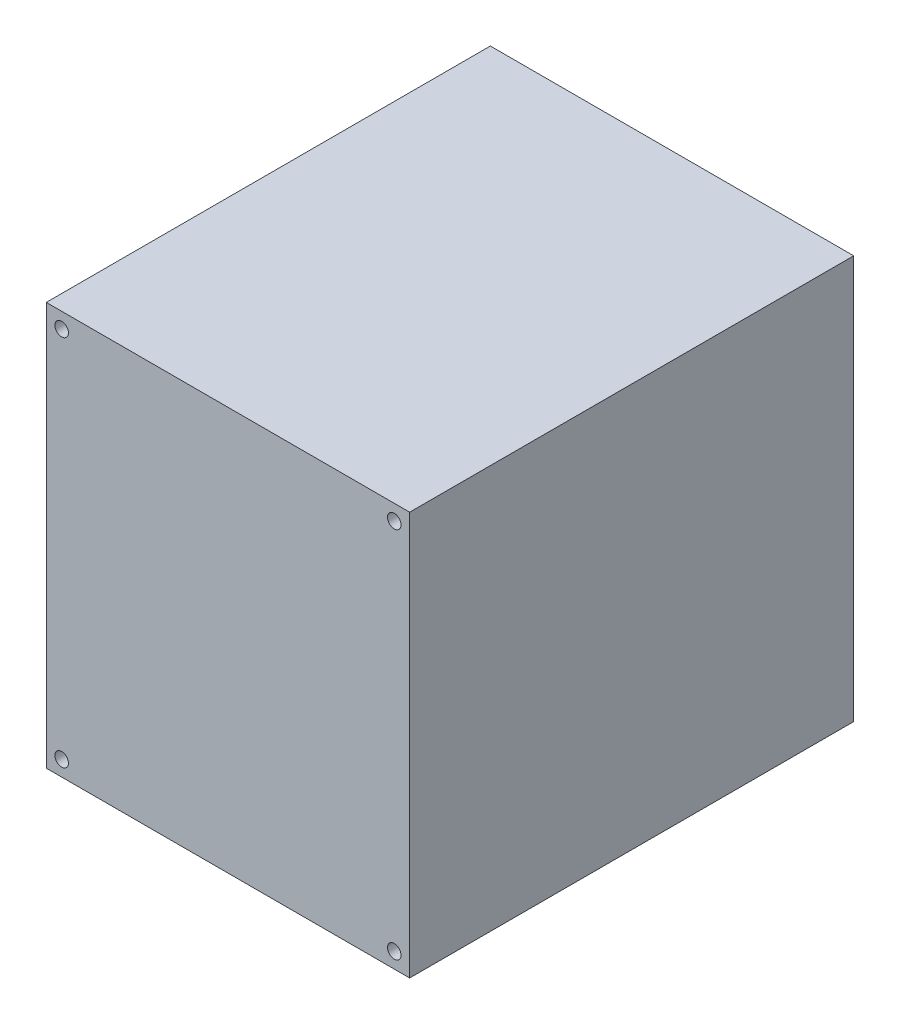
ISO-10303-21;
HEADER;
FILE_DESCRIPTION(('STEP AP214'),'2;1');
FILE_NAME('part.step','',(''),(''),'','','');
FILE_SCHEMA(('AUTOMOTIVE_DESIGN { 1 0 10303 214 1 1 1 1 }'));
ENDSEC;
DATA;
#1=APPLICATION_CONTEXT('core data for automotive mechanical design processes');
#2=APPLICATION_PROTOCOL_DEFINITION('international standard','automotive_design',2000,#1);
#3=PRODUCT_CONTEXT('',#1,'mechanical');
#4=PRODUCT('Part','Part','',(#3));
#5=PRODUCT_RELATED_PRODUCT_CATEGORY('part','',(#4));
#6=PRODUCT_DEFINITION_FORMATION('','',#4);
#7=PRODUCT_DEFINITION_CONTEXT('part definition',#1,'design');
#8=PRODUCT_DEFINITION('design','',#6,#7);
#9=PRODUCT_DEFINITION_SHAPE('','',#8);
#10=(LENGTH_UNIT() NAMED_UNIT(*) SI_UNIT(.MILLI.,.METRE.));
#11=(NAMED_UNIT(*) PLANE_ANGLE_UNIT() SI_UNIT($,.RADIAN.));
#12=(NAMED_UNIT(*) SI_UNIT($,.STERADIAN.) SOLID_ANGLE_UNIT());
#13=UNCERTAINTY_MEASURE_WITH_UNIT(LENGTH_MEASURE(1.E-05),#10,'distance_accuracy_value','');
#14=(GEOMETRIC_REPRESENTATION_CONTEXT(3) GLOBAL_UNCERTAINTY_ASSIGNED_CONTEXT((#13)) GLOBAL_UNIT_ASSIGNED_CONTEXT((#10,
#11,#12)) REPRESENTATION_CONTEXT('',''));
#15=CARTESIAN_POINT('',(0.,0.,0.));
#16=DIRECTION('',(0.,0.,1.));
#17=DIRECTION('',(1.,0.,0.));
#18=AXIS2_PLACEMENT_3D('',#15,#16,#17);
#19=CARTESIAN_POINT('',(59.,-65.5,144.2));
#20=DIRECTION('',(-1.,0.,0.));
#21=DIRECTION('',(0.,0.,1.));
#22=AXIS2_PLACEMENT_3D('',#19,#20,#21);
#23=PLANE('',#22);
#24=DIRECTION('',(0.,1.,0.));
#25=VECTOR('',#24,1.);
#26=CARTESIAN_POINT('',(59.,-65.5,0.));
#27=LINE('',#26,#25);
#28=CARTESIAN_POINT('',(59.,-65.5,0.));
#29=VERTEX_POINT('',#28);
#30=CARTESIAN_POINT('',(59.,65.5,0.));
#31=VERTEX_POINT('',#30);
#32=EDGE_CURVE('E98',#29,#31,#27,.T.);
#33=ORIENTED_EDGE('',*,*,#32,.T.);
#34=DIRECTION('',(0.,0.,-1.));
#35=VECTOR('',#34,1.);
#36=CARTESIAN_POINT('',(59.,65.5,144.2));
#37=LINE('',#36,#35);
#38=CARTESIAN_POINT('',(59.,65.5,144.2));
#39=VERTEX_POINT('',#38);
#40=EDGE_CURVE('E11',#39,#31,#37,.T.);
#41=ORIENTED_EDGE('',*,*,#40,.F.);
#42=DIRECTION('',(0.,1.,0.));
#43=VECTOR('',#42,1.);
#44=CARTESIAN_POINT('',(59.,-65.5,144.2));
#45=LINE('',#44,#43);
#46=CARTESIAN_POINT('',(59.,-65.5,144.2));
#47=VERTEX_POINT('',#46);
#48=EDGE_CURVE('E86',#47,#39,#45,.T.);
#49=ORIENTED_EDGE('',*,*,#48,.F.);
#50=DIRECTION('',(0.,0.,-1.));
#51=VECTOR('',#50,1.);
#52=CARTESIAN_POINT('',(59.,-65.5,144.2));
#53=LINE('',#52,#51);
#54=EDGE_CURVE('E94',#47,#29,#53,.T.);
#55=ORIENTED_EDGE('',*,*,#54,.T.);
#56=EDGE_LOOP('',(#33,#41,#49,#55));
#57=FACE_BOUND('',#56,.T.);
#58=ADVANCED_FACE('F35',(#57),#23,.F.);
#59=CARTESIAN_POINT('',(-59.,65.5,144.2));
#60=DIRECTION('',(0.,-1.,0.));
#61=DIRECTION('',(0.,0.,-1.));
#62=AXIS2_PLACEMENT_3D('',#59,#60,#61);
#63=PLANE('',#62);
#64=DIRECTION('',(-1.,0.,0.));
#65=VECTOR('',#64,1.);
#66=CARTESIAN_POINT('',(-59.,65.5,0.));
#67=LINE('',#66,#65);
#68=CARTESIAN_POINT('',(-59.,65.5,0.));
#69=VERTEX_POINT('',#68);
#70=EDGE_CURVE('E90',#31,#69,#67,.T.);
#71=ORIENTED_EDGE('',*,*,#70,.T.);
#72=DIRECTION('',(0.,0.,-1.));
#73=VECTOR('',#72,1.);
#74=CARTESIAN_POINT('',(-59.,65.5,144.2));
#75=LINE('',#74,#73);
#76=CARTESIAN_POINT('',(-59.,65.5,144.2));
#77=VERTEX_POINT('',#76);
#78=EDGE_CURVE('E43',#77,#69,#75,.T.);
#79=ORIENTED_EDGE('',*,*,#78,.F.);
#80=DIRECTION('',(-1.,0.,0.));
#81=VECTOR('',#80,1.);
#82=CARTESIAN_POINT('',(-59.,65.5,144.2));
#83=LINE('',#82,#81);
#84=EDGE_CURVE('E81',#39,#77,#83,.T.);
#85=ORIENTED_EDGE('',*,*,#84,.F.);
#86=ORIENTED_EDGE('',*,*,#40,.T.);
#87=EDGE_LOOP('',(#71,#79,#85,#86));
#88=FACE_BOUND('',#87,.T.);
#89=ADVANCED_FACE('F89',(#88),#63,.F.);
#90=CARTESIAN_POINT('',(-59.,-65.5,144.2));
#91=DIRECTION('',(1.,0.,0.));
#92=DIRECTION('',(0.,0.,-1.));
#93=AXIS2_PLACEMENT_3D('',#90,#91,#92);
#94=PLANE('',#93);
#95=DIRECTION('',(0.,-1.,0.));
#96=VECTOR('',#95,1.);
#97=CARTESIAN_POINT('',(-59.,-65.5,0.));
#98=LINE('',#97,#96);
#99=CARTESIAN_POINT('',(-59.,-65.5,0.));
#100=VERTEX_POINT('',#99);
#101=EDGE_CURVE('E68',#69,#100,#98,.T.);
#102=ORIENTED_EDGE('',*,*,#101,.T.);
#103=DIRECTION('',(0.,0.,-1.));
#104=VECTOR('',#103,1.);
#105=CARTESIAN_POINT('',(-59.,-65.5,144.2));
#106=LINE('',#105,#104);
#107=CARTESIAN_POINT('',(-59.,-65.5,144.2));
#108=VERTEX_POINT('',#107);
#109=EDGE_CURVE('E91',#108,#100,#106,.T.);
#110=ORIENTED_EDGE('',*,*,#109,.F.);
#111=DIRECTION('',(0.,-1.,0.));
#112=VECTOR('',#111,1.);
#113=CARTESIAN_POINT('',(-59.,-65.5,144.2));
#114=LINE('',#113,#112);
#115=EDGE_CURVE('E84',#77,#108,#114,.T.);
#116=ORIENTED_EDGE('',*,*,#115,.F.);
#117=ORIENTED_EDGE('',*,*,#78,.T.);
#118=EDGE_LOOP('',(#102,#110,#116,#117));
#119=FACE_BOUND('',#118,.T.);
#120=ADVANCED_FACE('F92',(#119),#94,.F.);
#121=CARTESIAN_POINT('',(-59.,-65.5,144.2));
#122=DIRECTION('',(0.,1.,0.));
#123=DIRECTION('',(0.,0.,1.));
#124=AXIS2_PLACEMENT_3D('',#121,#122,#123);
#125=PLANE('',#124);
#126=DIRECTION('',(1.,0.,0.));
#127=VECTOR('',#126,1.);
#128=CARTESIAN_POINT('',(-59.,-65.5,0.));
#129=LINE('',#128,#127);
#130=EDGE_CURVE('E74',#100,#29,#129,.T.);
#131=ORIENTED_EDGE('',*,*,#130,.T.);
#132=ORIENTED_EDGE('',*,*,#54,.F.);
#133=DIRECTION('',(1.,0.,0.));
#134=VECTOR('',#133,1.);
#135=CARTESIAN_POINT('',(-59.,-65.5,144.2));
#136=LINE('',#135,#134);
#137=EDGE_CURVE('E51',#108,#47,#136,.T.);
#138=ORIENTED_EDGE('',*,*,#137,.F.);
#139=ORIENTED_EDGE('',*,*,#109,.T.);
#140=EDGE_LOOP('',(#131,#132,#138,#139));
#141=FACE_BOUND('',#140,.T.);
#142=ADVANCED_FACE('F106',(#141),#125,.F.);
#143=CARTESIAN_POINT('',(0.,0.,144.2));
#144=DIRECTION('',(0.,0.,-1.));
#145=DIRECTION('',(-1.,0.,0.));
#146=AXIS2_PLACEMENT_3D('',#143,#144,#145);
#147=PLANE('',#146);
#148=CARTESIAN_POINT('',(54.,-60.5,144.2));
#149=DIRECTION('',(0.,0.,-1.));
#150=DIRECTION('',(-1.,0.,0.));
#151=AXIS2_PLACEMENT_3D('',#148,#149,#150);
#152=CIRCLE('',#151,2.19999999999999);
#153=CARTESIAN_POINT('',(51.8,-60.5,144.2));
#154=VERTEX_POINT('',#153);
#155=EDGE_CURVE('E121',#154,#154,#152,.T.);
#156=ORIENTED_EDGE('',*,*,#155,.T.);
#157=EDGE_LOOP('',(#156));
#158=FACE_BOUND('',#157,.T.);
#159=CARTESIAN_POINT('',(-54.,-60.5,144.2));
#160=DIRECTION('',(0.,0.,-1.));
#161=DIRECTION('',(-1.,0.,0.));
#162=AXIS2_PLACEMENT_3D('',#159,#160,#161);
#163=CIRCLE('',#162,2.19999999999999);
#164=CARTESIAN_POINT('',(-56.2,-60.5,144.2));
#165=VERTEX_POINT('',#164);
#166=EDGE_CURVE('E127',#165,#165,#163,.T.);
#167=ORIENTED_EDGE('',*,*,#166,.T.);
#168=EDGE_LOOP('',(#167));
#169=FACE_BOUND('',#168,.T.);
#170=CARTESIAN_POINT('',(-54.,60.5,144.2));
#171=DIRECTION('',(0.,0.,-1.));
#172=DIRECTION('',(-1.,0.,0.));
#173=AXIS2_PLACEMENT_3D('',#170,#171,#172);
#174=CIRCLE('',#173,2.2);
#175=CARTESIAN_POINT('',(-56.2,60.5,144.2));
#176=VERTEX_POINT('',#175);
#177=EDGE_CURVE('E115',#176,#176,#174,.T.);
#178=ORIENTED_EDGE('',*,*,#177,.T.);
#179=EDGE_LOOP('',(#178));
#180=FACE_BOUND('',#179,.T.);
#181=CARTESIAN_POINT('',(54.,60.5,144.2));
#182=DIRECTION('',(0.,0.,-1.));
#183=DIRECTION('',(-1.,0.,0.));
#184=AXIS2_PLACEMENT_3D('',#181,#182,#183);
#185=CIRCLE('',#184,2.2);
#186=CARTESIAN_POINT('',(51.8,60.5,144.2));
#187=VERTEX_POINT('',#186);
#188=EDGE_CURVE('E101',#187,#187,#185,.T.);
#189=ORIENTED_EDGE('',*,*,#188,.T.);
#190=EDGE_LOOP('',(#189));
#191=FACE_BOUND('',#190,.T.);
#192=ORIENTED_EDGE('',*,*,#48,.T.);
#193=ORIENTED_EDGE('',*,*,#84,.T.);
#194=ORIENTED_EDGE('',*,*,#115,.T.);
#195=ORIENTED_EDGE('',*,*,#137,.T.);
#196=EDGE_LOOP('',(#192,#193,#194,#195));
#197=FACE_BOUND('',#196,.T.);
#198=ADVANCED_FACE('F82',(#158,#169,#180,#191,#197),#147,.F.);
#199=CARTESIAN_POINT('',(0.,0.,0.));
#200=DIRECTION('',(0.,0.,-1.));
#201=DIRECTION('',(-1.,0.,0.));
#202=AXIS2_PLACEMENT_3D('',#199,#200,#201);
#203=PLANE('',#202);
#204=CARTESIAN_POINT('',(54.,-60.5,0.));
#205=DIRECTION('',(0.,0.,-1.));
#206=DIRECTION('',(-1.,0.,0.));
#207=AXIS2_PLACEMENT_3D('',#204,#205,#206);
#208=CIRCLE('',#207,2.19999999999999);
#209=CARTESIAN_POINT('',(51.8,-60.5,0.));
#210=VERTEX_POINT('',#209);
#211=EDGE_CURVE('E118',#210,#210,#208,.T.);
#212=ORIENTED_EDGE('',*,*,#211,.F.);
#213=EDGE_LOOP('',(#212));
#214=FACE_BOUND('',#213,.T.);
#215=CARTESIAN_POINT('',(-54.,-60.5,0.));
#216=DIRECTION('',(0.,0.,-1.));
#217=DIRECTION('',(-1.,0.,0.));
#218=AXIS2_PLACEMENT_3D('',#215,#216,#217);
#219=CIRCLE('',#218,2.19999999999999);
#220=CARTESIAN_POINT('',(-56.2,-60.5,0.));
#221=VERTEX_POINT('',#220);
#222=EDGE_CURVE('E124',#221,#221,#219,.T.);
#223=ORIENTED_EDGE('',*,*,#222,.F.);
#224=EDGE_LOOP('',(#223));
#225=FACE_BOUND('',#224,.T.);
#226=CARTESIAN_POINT('',(-54.,60.5,0.));
#227=DIRECTION('',(0.,0.,-1.));
#228=DIRECTION('',(-1.,0.,0.));
#229=AXIS2_PLACEMENT_3D('',#226,#227,#228);
#230=CIRCLE('',#229,2.2);
#231=CARTESIAN_POINT('',(-56.2,60.5,0.));
#232=VERTEX_POINT('',#231);
#233=EDGE_CURVE('E130',#232,#232,#230,.T.);
#234=ORIENTED_EDGE('',*,*,#233,.F.);
#235=EDGE_LOOP('',(#234));
#236=FACE_BOUND('',#235,.T.);
#237=CARTESIAN_POINT('',(54.,60.5,0.));
#238=DIRECTION('',(0.,0.,-1.));
#239=DIRECTION('',(-1.,0.,0.));
#240=AXIS2_PLACEMENT_3D('',#237,#238,#239);
#241=CIRCLE('',#240,2.2);
#242=CARTESIAN_POINT('',(51.8,60.5,0.));
#243=VERTEX_POINT('',#242);
#244=EDGE_CURVE('E112',#243,#243,#241,.T.);
#245=ORIENTED_EDGE('',*,*,#244,.F.);
#246=EDGE_LOOP('',(#245));
#247=FACE_BOUND('',#246,.T.);
#248=ORIENTED_EDGE('',*,*,#32,.F.);
#249=ORIENTED_EDGE('',*,*,#130,.F.);
#250=ORIENTED_EDGE('',*,*,#101,.F.);
#251=ORIENTED_EDGE('',*,*,#70,.F.);
#252=EDGE_LOOP('',(#248,#249,#250,#251));
#253=FACE_BOUND('',#252,.T.);
#254=ADVANCED_FACE('F109',(#214,#225,#236,#247,#253),#203,.T.);
#255=CARTESIAN_POINT('',(54.,60.5,144.2));
#256=DIRECTION('',(0.,0.,-1.));
#257=DIRECTION('',(-1.,0.,0.));
#258=AXIS2_PLACEMENT_3D('',#255,#256,#257);
#259=CYLINDRICAL_SURFACE('',#258,2.2);
#260=ORIENTED_EDGE('',*,*,#188,.F.);
#261=EDGE_LOOP('',(#260));
#262=FACE_BOUND('',#261,.T.);
#263=ORIENTED_EDGE('',*,*,#244,.T.);
#264=EDGE_LOOP('',(#263));
#265=FACE_BOUND('',#264,.T.);
#266=ADVANCED_FACE('F142',(#262,#265),#259,.F.);
#267=CARTESIAN_POINT('',(-54.,60.5,144.2));
#268=DIRECTION('',(0.,0.,-1.));
#269=DIRECTION('',(-1.,0.,0.));
#270=AXIS2_PLACEMENT_3D('',#267,#268,#269);
#271=CYLINDRICAL_SURFACE('',#270,2.2);
#272=ORIENTED_EDGE('',*,*,#177,.F.);
#273=EDGE_LOOP('',(#272));
#274=FACE_BOUND('',#273,.T.);
#275=ORIENTED_EDGE('',*,*,#233,.T.);
#276=EDGE_LOOP('',(#275));
#277=FACE_BOUND('',#276,.T.);
#278=ADVANCED_FACE('F138',(#274,#277),#271,.F.);
#279=CARTESIAN_POINT('',(-54.,-60.5,144.2));
#280=DIRECTION('',(0.,0.,-1.));
#281=DIRECTION('',(-1.,0.,0.));
#282=AXIS2_PLACEMENT_3D('',#279,#280,#281);
#283=CYLINDRICAL_SURFACE('',#282,2.19999999999999);
#284=ORIENTED_EDGE('',*,*,#166,.F.);
#285=EDGE_LOOP('',(#284));
#286=FACE_BOUND('',#285,.T.);
#287=ORIENTED_EDGE('',*,*,#222,.T.);
#288=EDGE_LOOP('',(#287));
#289=FACE_BOUND('',#288,.T.);
#290=ADVANCED_FACE('F141',(#286,#289),#283,.F.);
#291=CARTESIAN_POINT('',(54.,-60.5,144.2));
#292=DIRECTION('',(0.,0.,-1.));
#293=DIRECTION('',(-1.,0.,0.));
#294=AXIS2_PLACEMENT_3D('',#291,#292,#293);
#295=CYLINDRICAL_SURFACE('',#294,2.19999999999999);
#296=ORIENTED_EDGE('',*,*,#155,.F.);
#297=EDGE_LOOP('',(#296));
#298=FACE_BOUND('',#297,.T.);
#299=ORIENTED_EDGE('',*,*,#211,.T.);
#300=EDGE_LOOP('',(#299));
#301=FACE_BOUND('',#300,.T.);
#302=ADVANCED_FACE('F180',(#298,#301),#295,.F.);
#303=CLOSED_SHELL('',(#58,#89,#120,#142,#198,#254,#266,#278,#290,#302));
#304=MANIFOLD_SOLID_BREP('B2',#303);
#305=ADVANCED_BREP_SHAPE_REPRESENTATION('',(#18,#304),#14);
#306=SHAPE_DEFINITION_REPRESENTATION(#9,#305);
ENDSEC;
END-ISO-10303-21;
